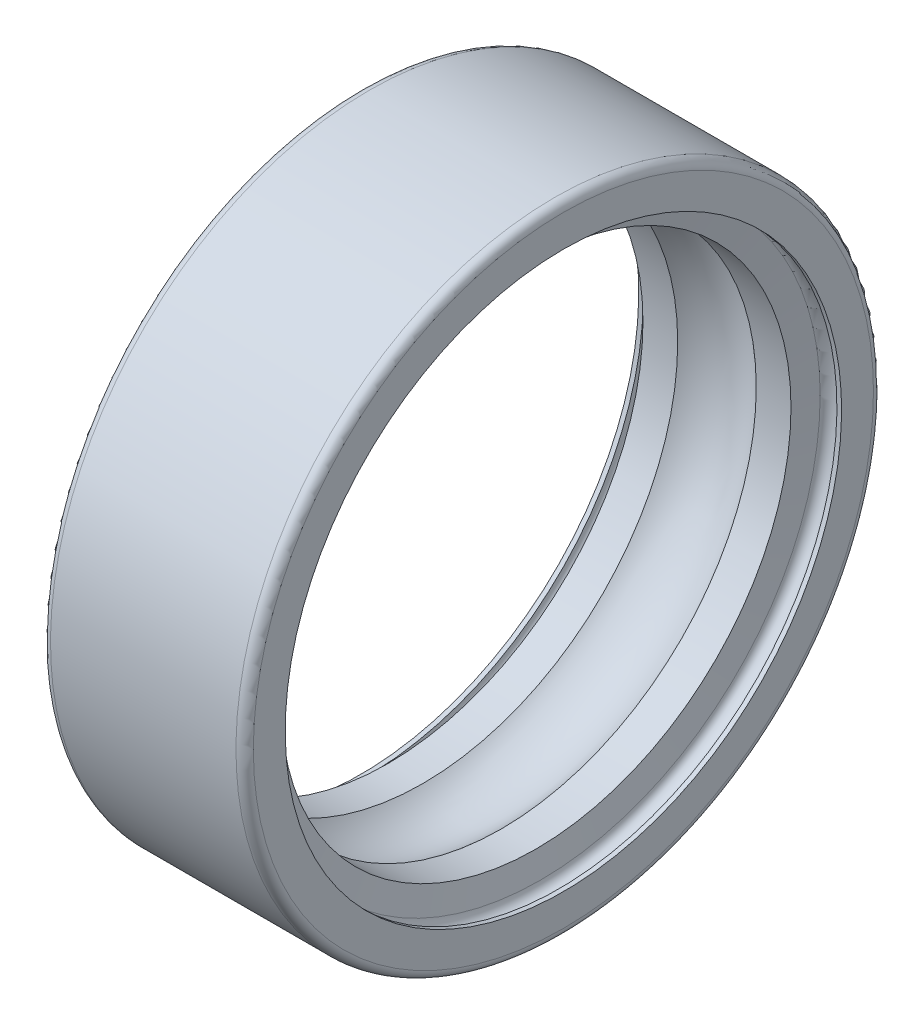
ISO-10303-21;
HEADER;
FILE_DESCRIPTION(('STEP AP214'),'2;1');
FILE_NAME('part.step','',(''),(''),'','','');
FILE_SCHEMA(('AUTOMOTIVE_DESIGN { 1 0 10303 214 1 1 1 1 }'));
ENDSEC;
DATA;
#1=APPLICATION_CONTEXT('core data for automotive mechanical design processes');
#2=APPLICATION_PROTOCOL_DEFINITION('international standard','automotive_design',2000,#1);
#3=PRODUCT_CONTEXT('',#1,'mechanical');
#4=PRODUCT('Part','Part','',(#3));
#5=PRODUCT_RELATED_PRODUCT_CATEGORY('part','',(#4));
#6=PRODUCT_DEFINITION_FORMATION('','',#4);
#7=PRODUCT_DEFINITION_CONTEXT('part definition',#1,'design');
#8=PRODUCT_DEFINITION('design','',#6,#7);
#9=PRODUCT_DEFINITION_SHAPE('','',#8);
#10=(LENGTH_UNIT() NAMED_UNIT(*) SI_UNIT(.MILLI.,.METRE.));
#11=(NAMED_UNIT(*) PLANE_ANGLE_UNIT() SI_UNIT($,.RADIAN.));
#12=(NAMED_UNIT(*) SI_UNIT($,.STERADIAN.) SOLID_ANGLE_UNIT());
#13=UNCERTAINTY_MEASURE_WITH_UNIT(LENGTH_MEASURE(1.E-05),#10,'distance_accuracy_value','');
#14=(GEOMETRIC_REPRESENTATION_CONTEXT(3) GLOBAL_UNCERTAINTY_ASSIGNED_CONTEXT((#13)) GLOBAL_UNIT_ASSIGNED_CONTEXT((#10,
#11,#12)) REPRESENTATION_CONTEXT('',''));
#15=CARTESIAN_POINT('',(0.,0.,0.));
#16=DIRECTION('',(0.,0.,1.));
#17=DIRECTION('',(1.,0.,0.));
#18=AXIS2_PLACEMENT_3D('',#15,#16,#17);
#19=CARTESIAN_POINT('',(6.52,0.,0.));
#20=DIRECTION('',(1.,0.,0.));
#21=DIRECTION('',(0.,0.,-1.));
#22=AXIS2_PLACEMENT_3D('',#19,#20,#21);
#23=TOROIDAL_SURFACE('',#22,9.6,0.32);
#24=CARTESIAN_POINT('',(6.84,0.,0.));
#25=DIRECTION('',(1.,0.,0.));
#26=DIRECTION('',(0.,1.,0.));
#27=AXIS2_PLACEMENT_3D('',#24,#25,#26);
#28=CIRCLE('',#27,9.6);
#29=CARTESIAN_POINT('',(6.84,9.6,0.));
#30=VERTEX_POINT('',#29);
#31=EDGE_CURVE('E11',#30,#30,#28,.T.);
#32=ORIENTED_EDGE('',*,*,#31,.T.);
#33=EDGE_LOOP('',(#32));
#34=FACE_BOUND('',#33,.T.);
#35=CARTESIAN_POINT('',(6.20486151903609,0.,0.));
#36=DIRECTION('',(1.,0.,0.));
#37=DIRECTION('',(0.,1.,0.));
#38=AXIS2_PLACEMENT_3D('',#35,#36,#37);
#39=CIRCLE('',#38,9.65556741685342);
#40=CARTESIAN_POINT('',(6.20486151903609,9.65556741685342,0.));
#41=VERTEX_POINT('',#40);
#42=EDGE_CURVE('E84',#41,#41,#39,.T.);
#43=ORIENTED_EDGE('',*,*,#42,.F.);
#44=EDGE_LOOP('',(#43));
#45=FACE_BOUND('',#44,.T.);
#46=ADVANCED_FACE('F16',(#34,#45),#23,.F.);
#47=CARTESIAN_POINT('',(6.92,0.,0.));
#48=DIRECTION('',(-1.,0.,0.));
#49=DIRECTION('',(0.,1.,0.));
#50=AXIS2_PLACEMENT_3D('',#47,#48,#49);
#51=CYLINDRICAL_SURFACE('',#50,9.6);
#52=CARTESIAN_POINT('',(7.,0.,0.));
#53=DIRECTION('',(1.,0.,0.));
#54=DIRECTION('',(0.,1.,0.));
#55=AXIS2_PLACEMENT_3D('',#52,#53,#54);
#56=CIRCLE('',#55,9.6);
#57=CARTESIAN_POINT('',(7.,9.6,0.));
#58=VERTEX_POINT('',#57);
#59=EDGE_CURVE('E20',#58,#58,#56,.T.);
#60=ORIENTED_EDGE('',*,*,#59,.T.);
#61=EDGE_LOOP('',(#60));
#62=FACE_BOUND('',#61,.T.);
#63=ORIENTED_EDGE('',*,*,#31,.F.);
#64=EDGE_LOOP('',(#63));
#65=FACE_BOUND('',#64,.T.);
#66=ADVANCED_FACE('F128',(#62,#65),#51,.F.);
#67=CARTESIAN_POINT('',(7.,10.15,0.));
#68=DIRECTION('',(1.,0.,0.));
#69=DIRECTION('',(0.,1.,0.));
#70=AXIS2_PLACEMENT_3D('',#67,#68,#69);
#71=PLANE('',#70);
#72=CARTESIAN_POINT('',(7.,0.,0.));
#73=DIRECTION('',(1.,0.,0.));
#74=DIRECTION('',(0.,1.,0.));
#75=AXIS2_PLACEMENT_3D('',#72,#73,#74);
#76=CIRCLE('',#75,10.7);
#77=CARTESIAN_POINT('',(7.,10.7,0.));
#78=VERTEX_POINT('',#77);
#79=EDGE_CURVE('E102',#78,#78,#76,.T.);
#80=ORIENTED_EDGE('',*,*,#79,.T.);
#81=EDGE_LOOP('',(#80));
#82=FACE_BOUND('',#81,.T.);
#83=ORIENTED_EDGE('',*,*,#59,.F.);
#84=EDGE_LOOP('',(#83));
#85=FACE_BOUND('',#84,.T.);
#86=ADVANCED_FACE('F132',(#82,#85),#71,.T.);
#87=CARTESIAN_POINT('',(6.7,0.,0.));
#88=DIRECTION('',(1.,0.,0.));
#89=DIRECTION('',(0.,0.,-1.));
#90=AXIS2_PLACEMENT_3D('',#87,#88,#89);
#91=TOROIDAL_SURFACE('',#90,10.7,0.3);
#92=CARTESIAN_POINT('',(6.7,0.,0.));
#93=DIRECTION('',(1.,0.,0.));
#94=DIRECTION('',(0.,1.,0.));
#95=AXIS2_PLACEMENT_3D('',#92,#93,#94);
#96=CIRCLE('',#95,11.);
#97=CARTESIAN_POINT('',(6.7,11.,0.));
#98=VERTEX_POINT('',#97);
#99=EDGE_CURVE('E66',#98,#98,#96,.T.);
#100=ORIENTED_EDGE('',*,*,#99,.T.);
#101=EDGE_LOOP('',(#100));
#102=FACE_BOUND('',#101,.T.);
#103=ORIENTED_EDGE('',*,*,#79,.F.);
#104=EDGE_LOOP('',(#103));
#105=FACE_BOUND('',#104,.T.);
#106=ADVANCED_FACE('F154',(#102,#105),#91,.T.);
#107=CARTESIAN_POINT('',(3.5,0.,0.));
#108=DIRECTION('',(-1.,0.,0.));
#109=DIRECTION('',(0.,1.,0.));
#110=AXIS2_PLACEMENT_3D('',#107,#108,#109);
#111=CYLINDRICAL_SURFACE('',#110,11.);
#112=CARTESIAN_POINT('',(0.3,0.,0.));
#113=DIRECTION('',(1.,0.,0.));
#114=DIRECTION('',(0.,1.,0.));
#115=AXIS2_PLACEMENT_3D('',#112,#113,#114);
#116=CIRCLE('',#115,11.);
#117=CARTESIAN_POINT('',(0.3,11.,0.));
#118=VERTEX_POINT('',#117);
#119=EDGE_CURVE('E71',#118,#118,#116,.T.);
#120=ORIENTED_EDGE('',*,*,#119,.T.);
#121=EDGE_LOOP('',(#120));
#122=FACE_BOUND('',#121,.T.);
#123=ORIENTED_EDGE('',*,*,#99,.F.);
#124=EDGE_LOOP('',(#123));
#125=FACE_BOUND('',#124,.T.);
#126=ADVANCED_FACE('F124',(#122,#125),#111,.T.);
#127=CARTESIAN_POINT('',(0.3,0.,0.));
#128=DIRECTION('',(1.,0.,0.));
#129=DIRECTION('',(0.,0.,-1.));
#130=AXIS2_PLACEMENT_3D('',#127,#128,#129);
#131=TOROIDAL_SURFACE('',#130,10.7,0.3);
#132=CARTESIAN_POINT('',(0.,0.,0.));
#133=DIRECTION('',(1.,0.,0.));
#134=DIRECTION('',(0.,1.,0.));
#135=AXIS2_PLACEMENT_3D('',#132,#133,#134);
#136=CIRCLE('',#135,10.7);
#137=CARTESIAN_POINT('',(0.,10.7,0.));
#138=VERTEX_POINT('',#137);
#139=EDGE_CURVE('E89',#138,#138,#136,.T.);
#140=ORIENTED_EDGE('',*,*,#139,.T.);
#141=EDGE_LOOP('',(#140));
#142=FACE_BOUND('',#141,.T.);
#143=ORIENTED_EDGE('',*,*,#119,.F.);
#144=EDGE_LOOP('',(#143));
#145=FACE_BOUND('',#144,.T.);
#146=ADVANCED_FACE('F112',(#142,#145),#131,.T.);
#147=CARTESIAN_POINT('',(0.,10.15,0.));
#148=DIRECTION('',(-1.,0.,0.));
#149=DIRECTION('',(0.,-1.,0.));
#150=AXIS2_PLACEMENT_3D('',#147,#148,#149);
#151=PLANE('',#150);
#152=CARTESIAN_POINT('',(0.,0.,0.));
#153=DIRECTION('',(1.,0.,0.));
#154=DIRECTION('',(0.,1.,0.));
#155=AXIS2_PLACEMENT_3D('',#152,#153,#154);
#156=CIRCLE('',#155,9.6);
#157=CARTESIAN_POINT('',(0.,9.6,0.));
#158=VERTEX_POINT('',#157);
#159=EDGE_CURVE('E98',#158,#158,#156,.T.);
#160=ORIENTED_EDGE('',*,*,#159,.T.);
#161=EDGE_LOOP('',(#160));
#162=FACE_BOUND('',#161,.T.);
#163=ORIENTED_EDGE('',*,*,#139,.F.);
#164=EDGE_LOOP('',(#163));
#165=FACE_BOUND('',#164,.T.);
#166=ADVANCED_FACE('F115',(#162,#165),#151,.T.);
#167=CARTESIAN_POINT('',(0.08,0.,0.));
#168=DIRECTION('',(-1.,0.,0.));
#169=DIRECTION('',(0.,1.,0.));
#170=AXIS2_PLACEMENT_3D('',#167,#168,#169);
#171=CYLINDRICAL_SURFACE('',#170,9.6);
#172=CARTESIAN_POINT('',(0.16,0.,0.));
#173=DIRECTION('',(1.,0.,0.));
#174=DIRECTION('',(0.,1.,0.));
#175=AXIS2_PLACEMENT_3D('',#172,#173,#174);
#176=CIRCLE('',#175,9.6);
#177=CARTESIAN_POINT('',(0.16,9.6,0.));
#178=VERTEX_POINT('',#177);
#179=EDGE_CURVE('E103',#178,#178,#176,.T.);
#180=ORIENTED_EDGE('',*,*,#179,.T.);
#181=EDGE_LOOP('',(#180));
#182=FACE_BOUND('',#181,.T.);
#183=ORIENTED_EDGE('',*,*,#159,.F.);
#184=EDGE_LOOP('',(#183));
#185=FACE_BOUND('',#184,.T.);
#186=ADVANCED_FACE('F18',(#182,#185),#171,.F.);
#187=CARTESIAN_POINT('',(0.48,0.,0.));
#188=DIRECTION('',(1.,0.,0.));
#189=DIRECTION('',(0.,0.,-1.));
#190=AXIS2_PLACEMENT_3D('',#187,#188,#189);
#191=TOROIDAL_SURFACE('',#190,9.6,0.32);
#192=CARTESIAN_POINT('',(0.795138480963905,0.,0.));
#193=DIRECTION('',(1.,0.,0.));
#194=DIRECTION('',(0.,1.,0.));
#195=AXIS2_PLACEMENT_3D('',#192,#193,#194);
#196=CIRCLE('',#195,9.65556741685342);
#197=CARTESIAN_POINT('',(0.795138480963905,9.65556741685342,0.));
#198=VERTEX_POINT('',#197);
#199=EDGE_CURVE('E91',#198,#198,#196,.T.);
#200=ORIENTED_EDGE('',*,*,#199,.T.);
#201=EDGE_LOOP('',(#200));
#202=FACE_BOUND('',#201,.T.);
#203=ORIENTED_EDGE('',*,*,#179,.F.);
#204=EDGE_LOOP('',(#203));
#205=FACE_BOUND('',#204,.T.);
#206=ADVANCED_FACE('F123',(#202,#205),#191,.F.);
#207=CARTESIAN_POINT('',(0.870568290667057,0.,0.));
#208=DIRECTION('',(-1.,0.,0.));
#209=DIRECTION('',(0.,1.,0.));
#210=AXIS2_PLACEMENT_3D('',#207,#208,#209);
#211=CONICAL_SURFACE('',#210,9.22778370842671,1.39626340159546);
#212=CARTESIAN_POINT('',(0.945998100370209,0.,0.));
#213=DIRECTION('',(1.,0.,0.));
#214=DIRECTION('',(0.,1.,0.));
#215=AXIS2_PLACEMENT_3D('',#212,#213,#214);
#216=CIRCLE('',#215,8.8);
#217=CARTESIAN_POINT('',(0.945998100370209,8.8,0.));
#218=VERTEX_POINT('',#217);
#219=EDGE_CURVE('E49',#218,#218,#216,.T.);
#220=ORIENTED_EDGE('',*,*,#219,.T.);
#221=EDGE_LOOP('',(#220));
#222=FACE_BOUND('',#221,.T.);
#223=ORIENTED_EDGE('',*,*,#199,.F.);
#224=EDGE_LOOP('',(#223));
#225=FACE_BOUND('',#224,.T.);
#226=ADVANCED_FACE('F148',(#222,#225),#211,.F.);
#227=CARTESIAN_POINT('',(1.54555158912263,0.,0.));
#228=DIRECTION('',(-1.,0.,0.));
#229=DIRECTION('',(0.,1.,0.));
#230=AXIS2_PLACEMENT_3D('',#227,#228,#229);
#231=CYLINDRICAL_SURFACE('',#230,8.8);
#232=CARTESIAN_POINT('',(2.14510507787504,0.,0.));
#233=DIRECTION('',(1.,0.,0.));
#234=DIRECTION('',(0.,1.,0.));
#235=AXIS2_PLACEMENT_3D('',#232,#233,#234);
#236=CIRCLE('',#235,8.8);
#237=CARTESIAN_POINT('',(2.14510507787504,8.8,0.));
#238=VERTEX_POINT('',#237);
#239=EDGE_CURVE('E56',#238,#238,#236,.T.);
#240=ORIENTED_EDGE('',*,*,#239,.T.);
#241=EDGE_LOOP('',(#240));
#242=FACE_BOUND('',#241,.T.);
#243=ORIENTED_EDGE('',*,*,#219,.F.);
#244=EDGE_LOOP('',(#243));
#245=FACE_BOUND('',#244,.T.);
#246=ADVANCED_FACE('F149',(#242,#245),#231,.F.);
#247=CARTESIAN_POINT('',(3.5,0.,0.));
#248=DIRECTION('',(1.,0.,0.));
#249=DIRECTION('',(0.,0.,-1.));
#250=AXIS2_PLACEMENT_3D('',#247,#248,#249);
#251=TOROIDAL_SURFACE('',#250,7.35,1.9845);
#252=CARTESIAN_POINT('',(4.85489492212496,0.,0.));
#253=DIRECTION('',(1.,0.,0.));
#254=DIRECTION('',(0.,1.,0.));
#255=AXIS2_PLACEMENT_3D('',#252,#253,#254);
#256=CIRCLE('',#255,8.8);
#257=CARTESIAN_POINT('',(4.85489492212496,8.8,0.));
#258=VERTEX_POINT('',#257);
#259=EDGE_CURVE('E86',#258,#258,#256,.T.);
#260=ORIENTED_EDGE('',*,*,#259,.T.);
#261=EDGE_LOOP('',(#260));
#262=FACE_BOUND('',#261,.T.);
#263=ORIENTED_EDGE('',*,*,#239,.F.);
#264=EDGE_LOOP('',(#263));
#265=FACE_BOUND('',#264,.T.);
#266=ADVANCED_FACE('F143',(#262,#265),#251,.F.);
#267=CARTESIAN_POINT('',(5.45444841087738,0.,0.));
#268=DIRECTION('',(-1.,0.,0.));
#269=DIRECTION('',(0.,1.,0.));
#270=AXIS2_PLACEMENT_3D('',#267,#268,#269);
#271=CYLINDRICAL_SURFACE('',#270,8.8);
#272=CARTESIAN_POINT('',(6.05400189962979,0.,0.));
#273=DIRECTION('',(1.,0.,0.));
#274=DIRECTION('',(0.,1.,0.));
#275=AXIS2_PLACEMENT_3D('',#272,#273,#274);
#276=CIRCLE('',#275,8.8);
#277=CARTESIAN_POINT('',(6.05400189962979,8.8,0.));
#278=VERTEX_POINT('',#277);
#279=EDGE_CURVE('E80',#278,#278,#276,.T.);
#280=ORIENTED_EDGE('',*,*,#279,.T.);
#281=EDGE_LOOP('',(#280));
#282=FACE_BOUND('',#281,.T.);
#283=ORIENTED_EDGE('',*,*,#259,.F.);
#284=EDGE_LOOP('',(#283));
#285=FACE_BOUND('',#284,.T.);
#286=ADVANCED_FACE('F81',(#282,#285),#271,.F.);
#287=CARTESIAN_POINT('',(6.12943170933294,0.,0.));
#288=DIRECTION('',(1.,0.,0.));
#289=DIRECTION('',(0.,1.,0.));
#290=AXIS2_PLACEMENT_3D('',#287,#288,#289);
#291=CONICAL_SURFACE('',#290,9.22778370842671,1.39626340159546);
#292=ORIENTED_EDGE('',*,*,#42,.T.);
#293=EDGE_LOOP('',(#292));
#294=FACE_BOUND('',#293,.T.);
#295=ORIENTED_EDGE('',*,*,#279,.F.);
#296=EDGE_LOOP('',(#295));
#297=FACE_BOUND('',#296,.T.);
#298=ADVANCED_FACE('F137',(#294,#297),#291,.F.);
#299=CLOSED_SHELL('',(#46,#66,#86,#106,#126,#146,#166,#186,#206,#226,#246,#266,#286,#298));
#300=MANIFOLD_SOLID_BREP('B1',#299);
#301=ADVANCED_BREP_SHAPE_REPRESENTATION('',(#18,#300),#14);
#302=SHAPE_DEFINITION_REPRESENTATION(#9,#301);
ENDSEC;
END-ISO-10303-21;
